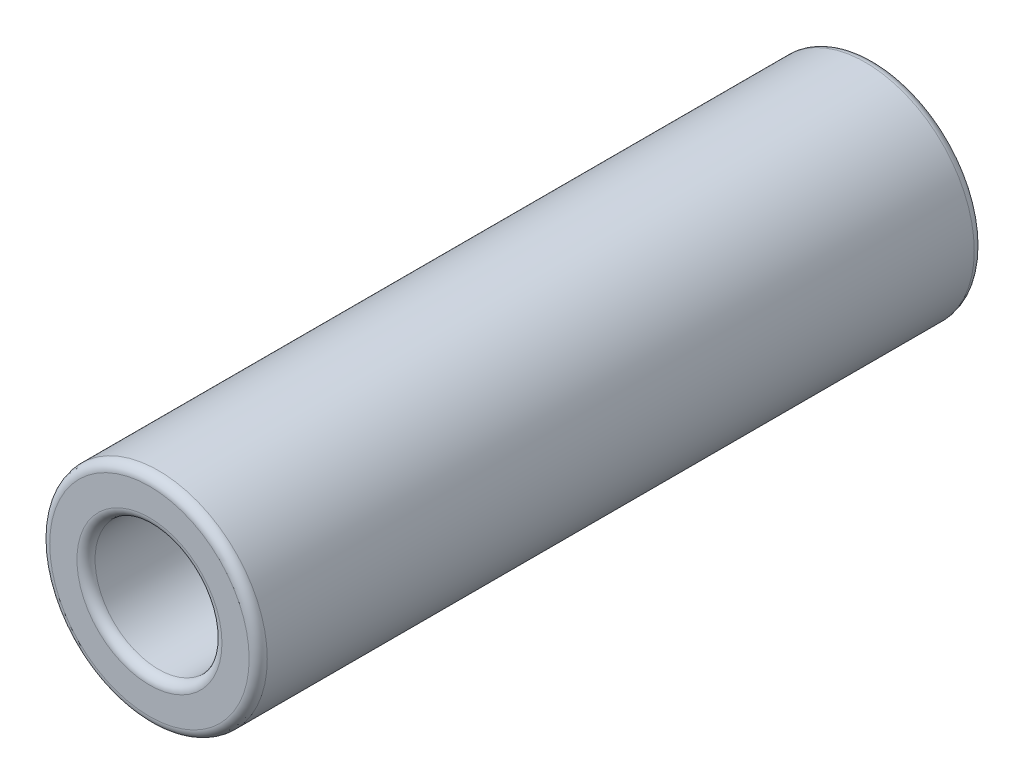
ISO-10303-21;
HEADER;
FILE_DESCRIPTION(('STEP AP214'),'2;1');
FILE_NAME('part.step','',(''),(''),'','','');
FILE_SCHEMA(('AUTOMOTIVE_DESIGN { 1 0 10303 214 1 1 1 1 }'));
ENDSEC;
DATA;
#1=APPLICATION_CONTEXT('core data for automotive mechanical design processes');
#2=APPLICATION_PROTOCOL_DEFINITION('international standard','automotive_design',2000,#1);
#3=PRODUCT_CONTEXT('',#1,'mechanical');
#4=PRODUCT('Part','Part','',(#3));
#5=PRODUCT_RELATED_PRODUCT_CATEGORY('part','',(#4));
#6=PRODUCT_DEFINITION_FORMATION('','',#4);
#7=PRODUCT_DEFINITION_CONTEXT('part definition',#1,'design');
#8=PRODUCT_DEFINITION('design','',#6,#7);
#9=PRODUCT_DEFINITION_SHAPE('','',#8);
#10=(LENGTH_UNIT() NAMED_UNIT(*) SI_UNIT(.MILLI.,.METRE.));
#11=(NAMED_UNIT(*) PLANE_ANGLE_UNIT() SI_UNIT($,.RADIAN.));
#12=(NAMED_UNIT(*) SI_UNIT($,.STERADIAN.) SOLID_ANGLE_UNIT());
#13=UNCERTAINTY_MEASURE_WITH_UNIT(LENGTH_MEASURE(1.E-05),#10,'distance_accuracy_value','');
#14=(GEOMETRIC_REPRESENTATION_CONTEXT(3) GLOBAL_UNCERTAINTY_ASSIGNED_CONTEXT((#13)) GLOBAL_UNIT_ASSIGNED_CONTEXT((#10,
#11,#12)) REPRESENTATION_CONTEXT('',''));
#15=CARTESIAN_POINT('',(0.,0.,0.));
#16=DIRECTION('',(0.,0.,1.));
#17=DIRECTION('',(1.,0.,0.));
#18=AXIS2_PLACEMENT_3D('',#15,#16,#17);
#19=CARTESIAN_POINT('',(0.,0.,40.));
#20=DIRECTION('',(0.,0.,1.));
#21=DIRECTION('',(1.,0.,0.));
#22=AXIS2_PLACEMENT_3D('',#19,#20,#21);
#23=PLANE('',#22);
#24=CARTESIAN_POINT('',(0.,0.,40.));
#25=DIRECTION('',(0.,0.,1.));
#26=DIRECTION('',(1.,0.,0.));
#27=AXIS2_PLACEMENT_3D('',#24,#25,#26);
#28=CIRCLE('',#27,4.);
#29=CARTESIAN_POINT('',(4.,0.,40.));
#30=VERTEX_POINT('',#29);
#31=EDGE_CURVE('E10',#30,#30,#28,.F.);
#32=ORIENTED_EDGE('',*,*,#31,.T.);
#33=EDGE_LOOP('',(#32));
#34=FACE_BOUND('',#33,.T.);
#35=CARTESIAN_POINT('',(0.,0.,40.));
#36=DIRECTION('',(0.,0.,1.));
#37=DIRECTION('',(1.,0.,0.));
#38=AXIS2_PLACEMENT_3D('',#35,#36,#37);
#39=CIRCLE('',#38,5.5);
#40=CARTESIAN_POINT('',(5.5,0.,40.));
#41=VERTEX_POINT('',#40);
#42=EDGE_CURVE('E49',#41,#41,#39,.T.);
#43=ORIENTED_EDGE('',*,*,#42,.T.);
#44=EDGE_LOOP('',(#43));
#45=FACE_BOUND('',#44,.T.);
#46=ADVANCED_FACE('F41',(#34,#45),#23,.T.);
#47=CARTESIAN_POINT('',(0.,0.,0.));
#48=DIRECTION('',(0.,0.,1.));
#49=DIRECTION('',(1.,0.,0.));
#50=AXIS2_PLACEMENT_3D('',#47,#48,#49);
#51=PLANE('',#50);
#52=CARTESIAN_POINT('',(0.,0.,0.));
#53=DIRECTION('',(0.,0.,1.));
#54=DIRECTION('',(1.,0.,0.));
#55=AXIS2_PLACEMENT_3D('',#52,#53,#54);
#56=CIRCLE('',#55,4.);
#57=CARTESIAN_POINT('',(4.,0.,0.));
#58=VERTEX_POINT('',#57);
#59=EDGE_CURVE('E73',#58,#58,#56,.T.);
#60=ORIENTED_EDGE('',*,*,#59,.T.);
#61=EDGE_LOOP('',(#60));
#62=FACE_BOUND('',#61,.T.);
#63=CARTESIAN_POINT('',(0.,0.,0.));
#64=DIRECTION('',(0.,0.,1.));
#65=DIRECTION('',(1.,0.,0.));
#66=AXIS2_PLACEMENT_3D('',#63,#64,#65);
#67=CIRCLE('',#66,5.5);
#68=CARTESIAN_POINT('',(5.5,0.,0.));
#69=VERTEX_POINT('',#68);
#70=EDGE_CURVE('E77',#69,#69,#67,.F.);
#71=ORIENTED_EDGE('',*,*,#70,.T.);
#72=EDGE_LOOP('',(#71));
#73=FACE_BOUND('',#72,.T.);
#74=ADVANCED_FACE('F82',(#62,#73),#51,.F.);
#75=CARTESIAN_POINT('',(0.,0.,40.));
#76=DIRECTION('',(0.,0.,-1.));
#77=DIRECTION('',(-1.,0.,0.));
#78=AXIS2_PLACEMENT_3D('',#75,#76,#77);
#79=CYLINDRICAL_SURFACE('',#78,6.);
#80=CARTESIAN_POINT('',(0.,0.,0.5));
#81=DIRECTION('',(0.,0.,1.));
#82=DIRECTION('',(1.,0.,0.));
#83=AXIS2_PLACEMENT_3D('',#80,#81,#82);
#84=CIRCLE('',#83,6.);
#85=CARTESIAN_POINT('',(6.,0.,0.5));
#86=VERTEX_POINT('',#85);
#87=EDGE_CURVE('E54',#86,#86,#84,.T.);
#88=ORIENTED_EDGE('',*,*,#87,.T.);
#89=EDGE_LOOP('',(#88));
#90=FACE_BOUND('',#89,.T.);
#91=CARTESIAN_POINT('',(0.,0.,39.5));
#92=DIRECTION('',(0.,0.,1.));
#93=DIRECTION('',(1.,0.,0.));
#94=AXIS2_PLACEMENT_3D('',#91,#92,#93);
#95=CIRCLE('',#94,6.);
#96=CARTESIAN_POINT('',(6.,0.,39.5));
#97=VERTEX_POINT('',#96);
#98=EDGE_CURVE('E59',#97,#97,#95,.F.);
#99=ORIENTED_EDGE('',*,*,#98,.T.);
#100=EDGE_LOOP('',(#99));
#101=FACE_BOUND('',#100,.T.);
#102=ADVANCED_FACE('F92',(#90,#101),#79,.T.);
#103=CARTESIAN_POINT('',(0.,0.,40.));
#104=DIRECTION('',(0.,0.,-1.));
#105=DIRECTION('',(-1.,0.,0.));
#106=AXIS2_PLACEMENT_3D('',#103,#104,#105);
#107=CYLINDRICAL_SURFACE('',#106,3.5);
#108=CARTESIAN_POINT('',(0.,0.,0.5));
#109=DIRECTION('',(0.,0.,1.));
#110=DIRECTION('',(1.,0.,0.));
#111=AXIS2_PLACEMENT_3D('',#108,#109,#110);
#112=CIRCLE('',#111,3.5);
#113=CARTESIAN_POINT('',(3.5,0.,0.5));
#114=VERTEX_POINT('',#113);
#115=EDGE_CURVE('E65',#114,#114,#112,.F.);
#116=ORIENTED_EDGE('',*,*,#115,.T.);
#117=EDGE_LOOP('',(#116));
#118=FACE_BOUND('',#117,.T.);
#119=CARTESIAN_POINT('',(0.,0.,39.5));
#120=DIRECTION('',(0.,0.,1.));
#121=DIRECTION('',(1.,0.,0.));
#122=AXIS2_PLACEMENT_3D('',#119,#120,#121);
#123=CIRCLE('',#122,3.5);
#124=CARTESIAN_POINT('',(3.5,0.,39.5));
#125=VERTEX_POINT('',#124);
#126=EDGE_CURVE('E69',#125,#125,#123,.T.);
#127=ORIENTED_EDGE('',*,*,#126,.T.);
#128=EDGE_LOOP('',(#127));
#129=FACE_BOUND('',#128,.T.);
#130=ADVANCED_FACE('F95',(#118,#129),#107,.F.);
#131=CARTESIAN_POINT('',(0.,0.,0.5));
#132=DIRECTION('',(0.,0.,1.));
#133=DIRECTION('',(1.,0.,0.));
#134=AXIS2_PLACEMENT_3D('',#131,#132,#133);
#135=TOROIDAL_SURFACE('',#134,4.,0.5);
#136=ORIENTED_EDGE('',*,*,#115,.F.);
#137=EDGE_LOOP('',(#136));
#138=FACE_BOUND('',#137,.T.);
#139=ORIENTED_EDGE('',*,*,#59,.F.);
#140=EDGE_LOOP('',(#139));
#141=FACE_BOUND('',#140,.T.);
#142=ADVANCED_FACE('F88',(#138,#141),#135,.T.);
#143=CARTESIAN_POINT('',(0.,0.,0.5));
#144=DIRECTION('',(0.,0.,1.));
#145=DIRECTION('',(1.,0.,0.));
#146=AXIS2_PLACEMENT_3D('',#143,#144,#145);
#147=TOROIDAL_SURFACE('',#146,5.5,0.5);
#148=ORIENTED_EDGE('',*,*,#70,.F.);
#149=EDGE_LOOP('',(#148));
#150=FACE_BOUND('',#149,.T.);
#151=ORIENTED_EDGE('',*,*,#87,.F.);
#152=EDGE_LOOP('',(#151));
#153=FACE_BOUND('',#152,.T.);
#154=ADVANCED_FACE('F84',(#150,#153),#147,.T.);
#155=CARTESIAN_POINT('',(0.,0.,39.5));
#156=DIRECTION('',(0.,0.,1.));
#157=DIRECTION('',(1.,0.,0.));
#158=AXIS2_PLACEMENT_3D('',#155,#156,#157);
#159=TOROIDAL_SURFACE('',#158,4.,0.5);
#160=ORIENTED_EDGE('',*,*,#31,.F.);
#161=EDGE_LOOP('',(#160));
#162=FACE_BOUND('',#161,.T.);
#163=ORIENTED_EDGE('',*,*,#126,.F.);
#164=EDGE_LOOP('',(#163));
#165=FACE_BOUND('',#164,.T.);
#166=ADVANCED_FACE('F87',(#162,#165),#159,.T.);
#167=CARTESIAN_POINT('',(0.,0.,39.5));
#168=DIRECTION('',(0.,0.,1.));
#169=DIRECTION('',(1.,0.,0.));
#170=AXIS2_PLACEMENT_3D('',#167,#168,#169);
#171=TOROIDAL_SURFACE('',#170,5.5,0.5);
#172=ORIENTED_EDGE('',*,*,#98,.F.);
#173=EDGE_LOOP('',(#172));
#174=FACE_BOUND('',#173,.T.);
#175=ORIENTED_EDGE('',*,*,#42,.F.);
#176=EDGE_LOOP('',(#175));
#177=FACE_BOUND('',#176,.T.);
#178=ADVANCED_FACE('F43',(#174,#177),#171,.T.);
#179=CLOSED_SHELL('',(#46,#74,#102,#130,#142,#154,#166,#178));
#180=MANIFOLD_SOLID_BREP('B2',#179);
#181=ADVANCED_BREP_SHAPE_REPRESENTATION('',(#18,#180),#14);
#182=SHAPE_DEFINITION_REPRESENTATION(#9,#181);
ENDSEC;
END-ISO-10303-21;
